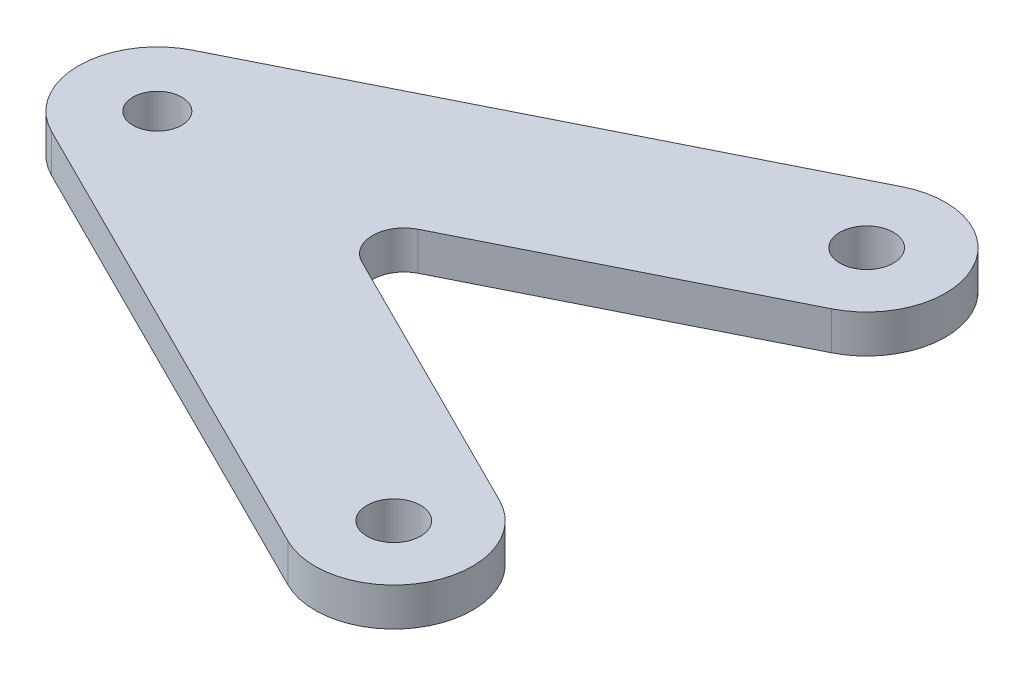
ISO-10303-21;
HEADER;
FILE_DESCRIPTION(('STEP AP214'),'2;1');
FILE_NAME('part.step','',(''),(''),'','','');
FILE_SCHEMA(('AUTOMOTIVE_DESIGN { 1 0 10303 214 1 1 1 1 }'));
ENDSEC;
DATA;
#1=APPLICATION_CONTEXT('core data for automotive mechanical design processes');
#2=APPLICATION_PROTOCOL_DEFINITION('international standard','automotive_design',2000,#1);
#3=PRODUCT_CONTEXT('',#1,'mechanical');
#4=PRODUCT('Part','Part','',(#3));
#5=PRODUCT_RELATED_PRODUCT_CATEGORY('part','',(#4));
#6=PRODUCT_DEFINITION_FORMATION('','',#4);
#7=PRODUCT_DEFINITION_CONTEXT('part definition',#1,'design');
#8=PRODUCT_DEFINITION('design','',#6,#7);
#9=PRODUCT_DEFINITION_SHAPE('','',#8);
#10=(LENGTH_UNIT() NAMED_UNIT(*) SI_UNIT(.MILLI.,.METRE.));
#11=(NAMED_UNIT(*) PLANE_ANGLE_UNIT() SI_UNIT($,.RADIAN.));
#12=(NAMED_UNIT(*) SI_UNIT($,.STERADIAN.) SOLID_ANGLE_UNIT());
#13=UNCERTAINTY_MEASURE_WITH_UNIT(LENGTH_MEASURE(1.E-05),#10,'distance_accuracy_value','');
#14=(GEOMETRIC_REPRESENTATION_CONTEXT(3) GLOBAL_UNCERTAINTY_ASSIGNED_CONTEXT((#13)) GLOBAL_UNIT_ASSIGNED_CONTEXT((#10,
#11,#12)) REPRESENTATION_CONTEXT('',''));
#15=CARTESIAN_POINT('',(0.,0.,0.));
#16=DIRECTION('',(0.,0.,1.));
#17=DIRECTION('',(1.,0.,0.));
#18=AXIS2_PLACEMENT_3D('',#15,#16,#17);
#19=CARTESIAN_POINT('',(30.,0.,-15.));
#20=DIRECTION('',(0.,-1.,0.));
#21=DIRECTION('',(0.,0.,-1.));
#22=AXIS2_PLACEMENT_3D('',#19,#20,#21);
#23=PLANE('',#22);
#24=CARTESIAN_POINT('',(30.,0.,-15.));
#25=DIRECTION('',(0.,1.,0.));
#26=DIRECTION('',(0.,0.,-1.));
#27=AXIS2_PLACEMENT_3D('',#24,#25,#26);
#28=CIRCLE('',#27,5.);
#29=CARTESIAN_POINT('',(32.2360679774998,0.,-10.5278640450004));
#30=VERTEX_POINT('',#29);
#31=CARTESIAN_POINT('',(27.7639320225002,0.,-19.4721359549996));
#32=VERTEX_POINT('',#31);
#33=EDGE_CURVE('E135',#30,#32,#28,.T.);
#34=ORIENTED_EDGE('',*,*,#33,.T.);
#35=DIRECTION('',(-0.894427190999916,0.,0.447213595499958));
#36=VECTOR('',#35,1.);
#37=CARTESIAN_POINT('',(27.7639320225002,0.,-19.4721359549996));
#38=LINE('',#37,#36);
#39=CARTESIAN_POINT('',(-2.23606797749979,0.,-4.47213595499958));
#40=VERTEX_POINT('',#39);
#41=EDGE_CURVE('E138',#32,#40,#38,.T.);
#42=ORIENTED_EDGE('',*,*,#41,.T.);
#43=CARTESIAN_POINT('',(0.,0.,0.));
#44=DIRECTION('',(0.,1.,0.));
#45=DIRECTION('',(0.,0.,-1.));
#46=AXIS2_PLACEMENT_3D('',#43,#44,#45);
#47=CIRCLE('',#46,5.);
#48=CARTESIAN_POINT('',(-2.23606797749979,0.,4.47213595499958));
#49=VERTEX_POINT('',#48);
#50=EDGE_CURVE('E142',#40,#49,#47,.T.);
#51=ORIENTED_EDGE('',*,*,#50,.T.);
#52=DIRECTION('',(0.894427190999916,0.,0.447213595499958));
#53=VECTOR('',#52,1.);
#54=CARTESIAN_POINT('',(-2.23606797749979,0.,4.47213595499958));
#55=LINE('',#54,#53);
#56=CARTESIAN_POINT('',(27.7639320225002,0.,19.4721359549996));
#57=VERTEX_POINT('',#56);
#58=EDGE_CURVE('E145',#49,#57,#55,.T.);
#59=ORIENTED_EDGE('',*,*,#58,.T.);
#60=CARTESIAN_POINT('',(30.,0.,15.));
#61=DIRECTION('',(0.,1.,0.));
#62=DIRECTION('',(0.,0.,1.));
#63=AXIS2_PLACEMENT_3D('',#60,#61,#62);
#64=CIRCLE('',#63,5.);
#65=CARTESIAN_POINT('',(32.2360679774998,0.,10.5278640450004));
#66=VERTEX_POINT('',#65);
#67=EDGE_CURVE('E148',#57,#66,#64,.T.);
#68=ORIENTED_EDGE('',*,*,#67,.T.);
#69=DIRECTION('',(-0.894427190999916,0.,-0.447213595499958));
#70=VECTOR('',#69,1.);
#71=CARTESIAN_POINT('',(14.7580486514986,0.,1.78885438199983));
#72=LINE('',#71,#70);
#73=CARTESIAN_POINT('',(14.7580486514986,0.,1.78885438199983));
#74=VERTEX_POINT('',#73);
#75=EDGE_CURVE('E151',#66,#74,#72,.T.);
#76=ORIENTED_EDGE('',*,*,#75,.T.);
#77=CARTESIAN_POINT('',(15.6524758424985,0.,0.));
#78=DIRECTION('',(0.,-1.,0.));
#79=DIRECTION('',(0.,0.,-1.));
#80=AXIS2_PLACEMENT_3D('',#77,#78,#79);
#81=CIRCLE('',#80,2.);
#82=CARTESIAN_POINT('',(14.7580486514986,0.,-1.78885438199983));
#83=VERTEX_POINT('',#82);
#84=EDGE_CURVE('E112',#74,#83,#81,.T.);
#85=ORIENTED_EDGE('',*,*,#84,.T.);
#86=DIRECTION('',(0.894427190999916,0.,-0.447213595499958));
#87=VECTOR('',#86,1.);
#88=CARTESIAN_POINT('',(32.2360679774998,0.,-10.5278640450004));
#89=LINE('',#88,#87);
#90=EDGE_CURVE('E154',#83,#30,#89,.T.);
#91=ORIENTED_EDGE('',*,*,#90,.T.);
#92=EDGE_LOOP('',(#34,#42,#51,#59,#68,#76,#85,#91));
#93=FACE_BOUND('',#92,.T.);
#94=CARTESIAN_POINT('',(0.,0.,0.));
#95=DIRECTION('',(0.,1.,0.));
#96=DIRECTION('',(0.,0.,1.));
#97=AXIS2_PLACEMENT_3D('',#94,#95,#96);
#98=CIRCLE('',#97,1.55);
#99=CARTESIAN_POINT('',(0.,0.,1.55));
#100=VERTEX_POINT('',#99);
#101=EDGE_CURVE('E214',#100,#100,#98,.T.);
#102=ORIENTED_EDGE('',*,*,#101,.F.);
#103=EDGE_LOOP('',(#102));
#104=FACE_BOUND('',#103,.T.);
#105=CARTESIAN_POINT('',(30.,0.,15.));
#106=DIRECTION('',(0.,1.,0.));
#107=DIRECTION('',(0.,0.,1.));
#108=AXIS2_PLACEMENT_3D('',#105,#106,#107);
#109=CIRCLE('',#108,1.69999999999999);
#110=CARTESIAN_POINT('',(30.,0.,16.7));
#111=VERTEX_POINT('',#110);
#112=EDGE_CURVE('E206',#111,#111,#109,.T.);
#113=ORIENTED_EDGE('',*,*,#112,.F.);
#114=EDGE_LOOP('',(#113));
#115=FACE_BOUND('',#114,.T.);
#116=CARTESIAN_POINT('',(30.,0.,-15.));
#117=DIRECTION('',(0.,1.,0.));
#118=DIRECTION('',(0.,0.,1.));
#119=AXIS2_PLACEMENT_3D('',#116,#117,#118);
#120=CIRCLE('',#119,1.69999999999999);
#121=CARTESIAN_POINT('',(30.,0.,-13.3));
#122=VERTEX_POINT('',#121);
#123=EDGE_CURVE('E203',#122,#122,#120,.T.);
#124=ORIENTED_EDGE('',*,*,#123,.F.);
#125=EDGE_LOOP('',(#124));
#126=FACE_BOUND('',#125,.T.);
#127=ADVANCED_FACE('F37',(#93,#104,#115,#126),#23,.F.);
#128=CARTESIAN_POINT('',(30.,-2.42,-15.));
#129=DIRECTION('',(0.,1.,0.));
#130=DIRECTION('',(0.,0.,1.));
#131=AXIS2_PLACEMENT_3D('',#128,#129,#130);
#132=CYLINDRICAL_SURFACE('',#131,5.);
#133=ORIENTED_EDGE('',*,*,#33,.F.);
#134=DIRECTION('',(0.,1.,0.));
#135=VECTOR('',#134,1.);
#136=CARTESIAN_POINT('',(32.2360679774998,-2.42,-10.5278640450004));
#137=LINE('',#136,#135);
#138=CARTESIAN_POINT('',(32.2360679774998,-2.42,-10.5278640450004));
#139=VERTEX_POINT('',#138);
#140=EDGE_CURVE('E11',#139,#30,#137,.T.);
#141=ORIENTED_EDGE('',*,*,#140,.F.);
#142=CARTESIAN_POINT('',(30.,-2.42,-15.));
#143=DIRECTION('',(0.,1.,0.));
#144=DIRECTION('',(0.,0.,-1.));
#145=AXIS2_PLACEMENT_3D('',#142,#143,#144);
#146=CIRCLE('',#145,5.);
#147=CARTESIAN_POINT('',(27.7639320225002,-2.42,-19.4721359549996));
#148=VERTEX_POINT('',#147);
#149=EDGE_CURVE('E156',#139,#148,#146,.T.);
#150=ORIENTED_EDGE('',*,*,#149,.T.);
#151=DIRECTION('',(0.,1.,0.));
#152=VECTOR('',#151,1.);
#153=CARTESIAN_POINT('',(27.7639320225002,-2.42,-19.4721359549996));
#154=LINE('',#153,#152);
#155=EDGE_CURVE('E41',#148,#32,#154,.T.);
#156=ORIENTED_EDGE('',*,*,#155,.T.);
#157=EDGE_LOOP('',(#133,#141,#150,#156));
#158=FACE_BOUND('',#157,.T.);
#159=ADVANCED_FACE('F39',(#158),#132,.T.);
#160=CARTESIAN_POINT('',(32.2360679774998,-2.42,-10.5278640450004));
#161=DIRECTION('',(0.447213595499958,0.,0.894427190999916));
#162=DIRECTION('',(0.894427190999916,0.,-0.447213595499958));
#163=AXIS2_PLACEMENT_3D('',#160,#161,#162);
#164=PLANE('',#163);
#165=ORIENTED_EDGE('',*,*,#90,.F.);
#166=DIRECTION('',(0.,1.,0.));
#167=VECTOR('',#166,1.);
#168=CARTESIAN_POINT('',(14.7580486514986,-2.42,-1.78885438199983));
#169=LINE('',#168,#167);
#170=CARTESIAN_POINT('',(14.7580486514986,-2.42,-1.78885438199983));
#171=VERTEX_POINT('',#170);
#172=EDGE_CURVE('E47',#171,#83,#169,.T.);
#173=ORIENTED_EDGE('',*,*,#172,.F.);
#174=DIRECTION('',(0.894427190999916,0.,-0.447213595499958));
#175=VECTOR('',#174,1.);
#176=CARTESIAN_POINT('',(32.2360679774998,-2.42,-10.5278640450004));
#177=LINE('',#176,#175);
#178=EDGE_CURVE('E125',#171,#139,#177,.T.);
#179=ORIENTED_EDGE('',*,*,#178,.T.);
#180=ORIENTED_EDGE('',*,*,#140,.T.);
#181=EDGE_LOOP('',(#165,#173,#179,#180));
#182=FACE_BOUND('',#181,.T.);
#183=ADVANCED_FACE('F168',(#182),#164,.T.);
#184=CARTESIAN_POINT('',(15.6524758424985,-2.42,0.));
#185=DIRECTION('',(0.,1.,0.));
#186=DIRECTION('',(0.,0.,1.));
#187=AXIS2_PLACEMENT_3D('',#184,#185,#186);
#188=CYLINDRICAL_SURFACE('',#187,2.);
#189=ORIENTED_EDGE('',*,*,#84,.F.);
#190=DIRECTION('',(0.,1.,0.));
#191=VECTOR('',#190,1.);
#192=CARTESIAN_POINT('',(14.7580486514986,-2.42,1.78885438199983));
#193=LINE('',#192,#191);
#194=CARTESIAN_POINT('',(14.7580486514986,-2.42,1.78885438199983));
#195=VERTEX_POINT('',#194);
#196=EDGE_CURVE('E107',#195,#74,#193,.T.);
#197=ORIENTED_EDGE('',*,*,#196,.F.);
#198=CARTESIAN_POINT('',(15.6524758424985,-2.42,0.));
#199=DIRECTION('',(0.,-1.,0.));
#200=DIRECTION('',(0.,0.,-1.));
#201=AXIS2_PLACEMENT_3D('',#198,#199,#200);
#202=CIRCLE('',#201,2.);
#203=EDGE_CURVE('E110',#195,#171,#202,.T.);
#204=ORIENTED_EDGE('',*,*,#203,.T.);
#205=ORIENTED_EDGE('',*,*,#172,.T.);
#206=EDGE_LOOP('',(#189,#197,#204,#205));
#207=FACE_BOUND('',#206,.T.);
#208=ADVANCED_FACE('F109',(#207),#188,.F.);
#209=CARTESIAN_POINT('',(14.7580486514986,-2.42,1.78885438199983));
#210=DIRECTION('',(0.447213595499958,0.,-0.894427190999916));
#211=DIRECTION('',(-0.894427190999916,0.,-0.447213595499958));
#212=AXIS2_PLACEMENT_3D('',#209,#210,#211);
#213=PLANE('',#212);
#214=ORIENTED_EDGE('',*,*,#75,.F.);
#215=DIRECTION('',(0.,1.,0.));
#216=VECTOR('',#215,1.);
#217=CARTESIAN_POINT('',(32.2360679774998,-2.42,10.5278640450004));
#218=LINE('',#217,#216);
#219=CARTESIAN_POINT('',(32.2360679774998,-2.42,10.5278640450004));
#220=VERTEX_POINT('',#219);
#221=EDGE_CURVE('E117',#220,#66,#218,.T.);
#222=ORIENTED_EDGE('',*,*,#221,.F.);
#223=DIRECTION('',(-0.894427190999916,0.,-0.447213595499958));
#224=VECTOR('',#223,1.);
#225=CARTESIAN_POINT('',(14.7580486514986,-2.42,1.78885438199983));
#226=LINE('',#225,#224);
#227=EDGE_CURVE('E123',#220,#195,#226,.T.);
#228=ORIENTED_EDGE('',*,*,#227,.T.);
#229=ORIENTED_EDGE('',*,*,#196,.T.);
#230=EDGE_LOOP('',(#214,#222,#228,#229));
#231=FACE_BOUND('',#230,.T.);
#232=ADVANCED_FACE('F127',(#231),#213,.T.);
#233=CARTESIAN_POINT('',(30.,-2.42,15.));
#234=DIRECTION('',(0.,1.,0.));
#235=DIRECTION('',(0.,0.,1.));
#236=AXIS2_PLACEMENT_3D('',#233,#234,#235);
#237=CYLINDRICAL_SURFACE('',#236,5.);
#238=ORIENTED_EDGE('',*,*,#67,.F.);
#239=DIRECTION('',(0.,1.,0.));
#240=VECTOR('',#239,1.);
#241=CARTESIAN_POINT('',(27.7639320225002,-2.42,19.4721359549996));
#242=LINE('',#241,#240);
#243=CARTESIAN_POINT('',(27.7639320225002,-2.42,19.4721359549996));
#244=VERTEX_POINT('',#243);
#245=EDGE_CURVE('E160',#244,#57,#242,.T.);
#246=ORIENTED_EDGE('',*,*,#245,.F.);
#247=CARTESIAN_POINT('',(30.,-2.42,15.));
#248=DIRECTION('',(0.,1.,0.));
#249=DIRECTION('',(0.,0.,1.));
#250=AXIS2_PLACEMENT_3D('',#247,#248,#249);
#251=CIRCLE('',#250,5.);
#252=EDGE_CURVE('E128',#244,#220,#251,.T.);
#253=ORIENTED_EDGE('',*,*,#252,.T.);
#254=ORIENTED_EDGE('',*,*,#221,.T.);
#255=EDGE_LOOP('',(#238,#246,#253,#254));
#256=FACE_BOUND('',#255,.T.);
#257=ADVANCED_FACE('F234',(#256),#237,.T.);
#258=CARTESIAN_POINT('',(-2.23606797749979,-2.42,4.47213595499958));
#259=DIRECTION('',(-0.447213595499958,0.,0.894427190999916));
#260=DIRECTION('',(0.894427190999916,0.,0.447213595499958));
#261=AXIS2_PLACEMENT_3D('',#258,#259,#260);
#262=PLANE('',#261);
#263=ORIENTED_EDGE('',*,*,#58,.F.);
#264=DIRECTION('',(0.,1.,0.));
#265=VECTOR('',#264,1.);
#266=CARTESIAN_POINT('',(-2.23606797749979,-2.42,4.47213595499958));
#267=LINE('',#266,#265);
#268=CARTESIAN_POINT('',(-2.23606797749979,-2.42,4.47213595499958));
#269=VERTEX_POINT('',#268);
#270=EDGE_CURVE('E162',#269,#49,#267,.T.);
#271=ORIENTED_EDGE('',*,*,#270,.F.);
#272=DIRECTION('',(0.894427190999916,0.,0.447213595499958));
#273=VECTOR('',#272,1.);
#274=CARTESIAN_POINT('',(-2.23606797749979,-2.42,4.47213595499958));
#275=LINE('',#274,#273);
#276=EDGE_CURVE('E130',#269,#244,#275,.T.);
#277=ORIENTED_EDGE('',*,*,#276,.T.);
#278=ORIENTED_EDGE('',*,*,#245,.T.);
#279=EDGE_LOOP('',(#263,#271,#277,#278));
#280=FACE_BOUND('',#279,.T.);
#281=ADVANCED_FACE('F228',(#280),#262,.T.);
#282=CARTESIAN_POINT('',(0.,-2.42,0.));
#283=DIRECTION('',(0.,1.,0.));
#284=DIRECTION('',(0.,0.,1.));
#285=AXIS2_PLACEMENT_3D('',#282,#283,#284);
#286=CYLINDRICAL_SURFACE('',#285,5.);
#287=ORIENTED_EDGE('',*,*,#50,.F.);
#288=DIRECTION('',(0.,1.,0.));
#289=VECTOR('',#288,1.);
#290=CARTESIAN_POINT('',(-2.23606797749979,-2.42,-4.47213595499958));
#291=LINE('',#290,#289);
#292=CARTESIAN_POINT('',(-2.23606797749979,-2.42,-4.47213595499958));
#293=VERTEX_POINT('',#292);
#294=EDGE_CURVE('E163',#293,#40,#291,.T.);
#295=ORIENTED_EDGE('',*,*,#294,.F.);
#296=CARTESIAN_POINT('',(0.,-2.42,0.));
#297=DIRECTION('',(0.,1.,0.));
#298=DIRECTION('',(0.,0.,-1.));
#299=AXIS2_PLACEMENT_3D('',#296,#297,#298);
#300=CIRCLE('',#299,5.);
#301=EDGE_CURVE('E222',#293,#269,#300,.T.);
#302=ORIENTED_EDGE('',*,*,#301,.T.);
#303=ORIENTED_EDGE('',*,*,#270,.T.);
#304=EDGE_LOOP('',(#287,#295,#302,#303));
#305=FACE_BOUND('',#304,.T.);
#306=ADVANCED_FACE('F232',(#305),#286,.T.);
#307=CARTESIAN_POINT('',(27.7639320225002,-2.42,-19.4721359549996));
#308=DIRECTION('',(-0.447213595499958,0.,-0.894427190999916));
#309=DIRECTION('',(-0.894427190999916,0.,0.447213595499958));
#310=AXIS2_PLACEMENT_3D('',#307,#308,#309);
#311=PLANE('',#310);
#312=ORIENTED_EDGE('',*,*,#41,.F.);
#313=ORIENTED_EDGE('',*,*,#155,.F.);
#314=DIRECTION('',(-0.894427190999916,0.,0.447213595499958));
#315=VECTOR('',#314,1.);
#316=CARTESIAN_POINT('',(27.7639320225002,-2.42,-19.4721359549996));
#317=LINE('',#316,#315);
#318=EDGE_CURVE('E220',#148,#293,#317,.T.);
#319=ORIENTED_EDGE('',*,*,#318,.T.);
#320=ORIENTED_EDGE('',*,*,#294,.T.);
#321=EDGE_LOOP('',(#312,#313,#319,#320));
#322=FACE_BOUND('',#321,.T.);
#323=ADVANCED_FACE('F165',(#322),#311,.T.);
#324=CARTESIAN_POINT('',(30.,-2.42,-15.));
#325=DIRECTION('',(0.,-1.,0.));
#326=DIRECTION('',(0.,0.,-1.));
#327=AXIS2_PLACEMENT_3D('',#324,#325,#326);
#328=PLANE('',#327);
#329=CARTESIAN_POINT('',(30.,-2.42,-15.));
#330=DIRECTION('',(0.,1.,0.));
#331=DIRECTION('',(0.,0.,1.));
#332=AXIS2_PLACEMENT_3D('',#329,#330,#331);
#333=CIRCLE('',#332,1.7);
#334=CARTESIAN_POINT('',(30.,-2.42,-13.3));
#335=VERTEX_POINT('',#334);
#336=EDGE_CURVE('E200',#335,#335,#333,.T.);
#337=ORIENTED_EDGE('',*,*,#336,.T.);
#338=EDGE_LOOP('',(#337));
#339=FACE_BOUND('',#338,.T.);
#340=CARTESIAN_POINT('',(30.,-2.42,15.));
#341=DIRECTION('',(0.,1.,0.));
#342=DIRECTION('',(0.,0.,1.));
#343=AXIS2_PLACEMENT_3D('',#340,#341,#342);
#344=CIRCLE('',#343,1.7);
#345=CARTESIAN_POINT('',(30.,-2.42,16.7));
#346=VERTEX_POINT('',#345);
#347=EDGE_CURVE('E211',#346,#346,#344,.T.);
#348=ORIENTED_EDGE('',*,*,#347,.T.);
#349=EDGE_LOOP('',(#348));
#350=FACE_BOUND('',#349,.T.);
#351=CARTESIAN_POINT('',(0.,-2.42,0.));
#352=DIRECTION('',(0.,1.,0.));
#353=DIRECTION('',(0.,0.,1.));
#354=AXIS2_PLACEMENT_3D('',#351,#352,#353);
#355=CIRCLE('',#354,1.55);
#356=CARTESIAN_POINT('',(0.,-2.42,1.55));
#357=VERTEX_POINT('',#356);
#358=EDGE_CURVE('E139',#357,#357,#355,.T.);
#359=ORIENTED_EDGE('',*,*,#358,.T.);
#360=EDGE_LOOP('',(#359));
#361=FACE_BOUND('',#360,.T.);
#362=ORIENTED_EDGE('',*,*,#149,.F.);
#363=ORIENTED_EDGE('',*,*,#178,.F.);
#364=ORIENTED_EDGE('',*,*,#203,.F.);
#365=ORIENTED_EDGE('',*,*,#227,.F.);
#366=ORIENTED_EDGE('',*,*,#252,.F.);
#367=ORIENTED_EDGE('',*,*,#276,.F.);
#368=ORIENTED_EDGE('',*,*,#301,.F.);
#369=ORIENTED_EDGE('',*,*,#318,.F.);
#370=EDGE_LOOP('',(#362,#363,#364,#365,#366,#367,#368,#369));
#371=FACE_BOUND('',#370,.T.);
#372=ADVANCED_FACE('F121',(#339,#350,#361,#371),#328,.T.);
#373=CARTESIAN_POINT('',(0.,-2.42,0.));
#374=DIRECTION('',(0.,1.,0.));
#375=DIRECTION('',(0.,0.,1.));
#376=AXIS2_PLACEMENT_3D('',#373,#374,#375);
#377=CYLINDRICAL_SURFACE('',#376,1.55);
#378=ORIENTED_EDGE('',*,*,#358,.F.);
#379=EDGE_LOOP('',(#378));
#380=FACE_BOUND('',#379,.T.);
#381=ORIENTED_EDGE('',*,*,#101,.T.);
#382=EDGE_LOOP('',(#381));
#383=FACE_BOUND('',#382,.T.);
#384=ADVANCED_FACE('F183',(#380,#383),#377,.F.);
#385=CARTESIAN_POINT('',(30.,0.,15.));
#386=DIRECTION('',(0.,1.,0.));
#387=DIRECTION('',(0.,0.,1.));
#388=AXIS2_PLACEMENT_3D('',#385,#386,#387);
#389=CYLINDRICAL_SURFACE('',#388,1.69999999999999);
#390=ORIENTED_EDGE('',*,*,#347,.F.);
#391=EDGE_LOOP('',(#390));
#392=FACE_BOUND('',#391,.T.);
#393=ORIENTED_EDGE('',*,*,#112,.T.);
#394=EDGE_LOOP('',(#393));
#395=FACE_BOUND('',#394,.T.);
#396=ADVANCED_FACE('F187',(#392,#395),#389,.F.);
#397=CARTESIAN_POINT('',(30.,0.,-15.));
#398=DIRECTION('',(0.,1.,0.));
#399=DIRECTION('',(0.,0.,1.));
#400=AXIS2_PLACEMENT_3D('',#397,#398,#399);
#401=CYLINDRICAL_SURFACE('',#400,1.69999999999999);
#402=ORIENTED_EDGE('',*,*,#336,.F.);
#403=EDGE_LOOP('',(#402));
#404=FACE_BOUND('',#403,.T.);
#405=ORIENTED_EDGE('',*,*,#123,.T.);
#406=EDGE_LOOP('',(#405));
#407=FACE_BOUND('',#406,.T.);
#408=ADVANCED_FACE('F191',(#404,#407),#401,.F.);
#409=CLOSED_SHELL('',(#127,#159,#183,#208,#232,#257,#281,#306,#323,#372,#384,#396,#408));
#410=MANIFOLD_SOLID_BREP('B2',#409);
#411=ADVANCED_BREP_SHAPE_REPRESENTATION('',(#18,#410),#14);
#412=SHAPE_DEFINITION_REPRESENTATION(#9,#411);
ENDSEC;
END-ISO-10303-21;
